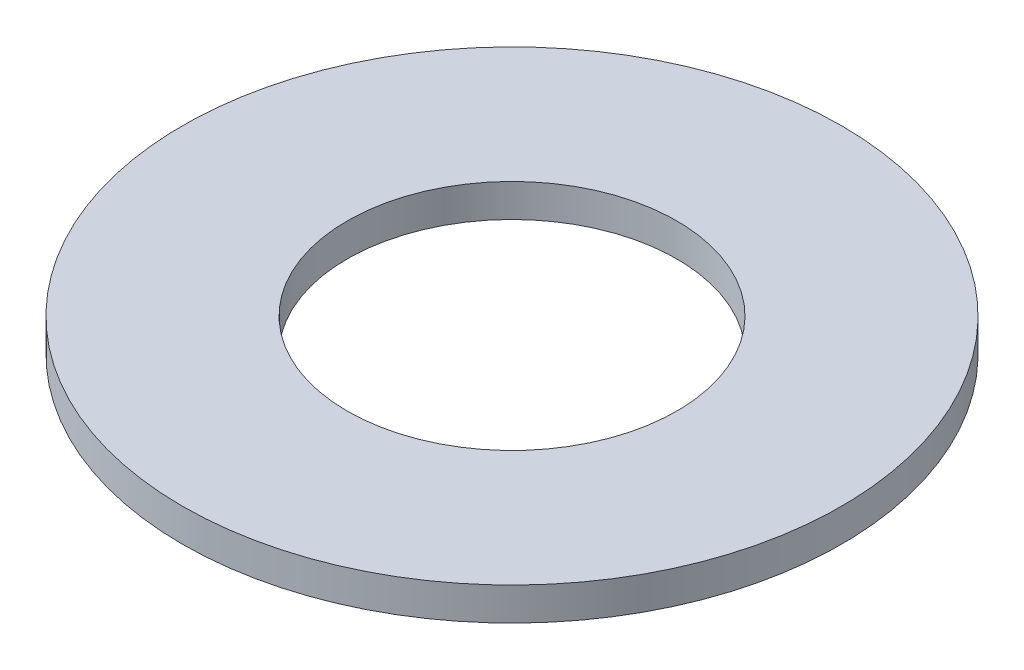
ISO-10303-21;
HEADER;
FILE_DESCRIPTION(('STEP AP214'),'2;1');
FILE_NAME('part.step','',(''),(''),'','','');
FILE_SCHEMA(('AUTOMOTIVE_DESIGN { 1 0 10303 214 1 1 1 1 }'));
ENDSEC;
DATA;
#1=APPLICATION_CONTEXT('core data for automotive mechanical design processes');
#2=APPLICATION_PROTOCOL_DEFINITION('international standard','automotive_design',2000,#1);
#3=PRODUCT_CONTEXT('',#1,'mechanical');
#4=PRODUCT('Part','Part','',(#3));
#5=PRODUCT_RELATED_PRODUCT_CATEGORY('part','',(#4));
#6=PRODUCT_DEFINITION_FORMATION('','',#4);
#7=PRODUCT_DEFINITION_CONTEXT('part definition',#1,'design');
#8=PRODUCT_DEFINITION('design','',#6,#7);
#9=PRODUCT_DEFINITION_SHAPE('','',#8);
#10=(LENGTH_UNIT() NAMED_UNIT(*) SI_UNIT(.MILLI.,.METRE.));
#11=(NAMED_UNIT(*) PLANE_ANGLE_UNIT() SI_UNIT($,.RADIAN.));
#12=(NAMED_UNIT(*) SI_UNIT($,.STERADIAN.) SOLID_ANGLE_UNIT());
#13=UNCERTAINTY_MEASURE_WITH_UNIT(LENGTH_MEASURE(1.E-05),#10,'distance_accuracy_value','');
#14=(GEOMETRIC_REPRESENTATION_CONTEXT(3) GLOBAL_UNCERTAINTY_ASSIGNED_CONTEXT((#13)) GLOBAL_UNIT_ASSIGNED_CONTEXT((#10,
#11,#12)) REPRESENTATION_CONTEXT('',''));
#15=CARTESIAN_POINT('',(0.,0.,0.));
#16=DIRECTION('',(0.,0.,1.));
#17=DIRECTION('',(1.,0.,0.));
#18=AXIS2_PLACEMENT_3D('',#15,#16,#17);
#19=CARTESIAN_POINT('',(0.,1.,0.));
#20=DIRECTION('',(0.,1.,0.));
#21=DIRECTION('',(0.,0.,1.));
#22=AXIS2_PLACEMENT_3D('',#19,#20,#21);
#23=PLANE('',#22);
#24=CARTESIAN_POINT('',(0.,1.,0.));
#25=DIRECTION('',(0.,1.,0.));
#26=DIRECTION('',(0.,0.,1.));
#27=AXIS2_PLACEMENT_3D('',#24,#25,#26);
#28=CIRCLE('',#27,10.);
#29=CARTESIAN_POINT('',(0.,1.,10.));
#30=VERTEX_POINT('',#29);
#31=EDGE_CURVE('E10',#30,#30,#28,.T.);
#32=ORIENTED_EDGE('',*,*,#31,.T.);
#33=EDGE_LOOP('',(#32));
#34=FACE_BOUND('',#33,.T.);
#35=CARTESIAN_POINT('',(0.,1.,0.));
#36=DIRECTION('',(0.,1.,0.));
#37=DIRECTION('',(0.,0.,1.));
#38=AXIS2_PLACEMENT_3D('',#35,#36,#37);
#39=CIRCLE('',#38,5.);
#40=CARTESIAN_POINT('',(0.,1.,5.));
#41=VERTEX_POINT('',#40);
#42=EDGE_CURVE('E42',#41,#41,#39,.T.);
#43=ORIENTED_EDGE('',*,*,#42,.F.);
#44=EDGE_LOOP('',(#43));
#45=FACE_BOUND('',#44,.T.);
#46=ADVANCED_FACE('F31',(#34,#45),#23,.T.);
#47=CARTESIAN_POINT('',(0.,0.,0.));
#48=DIRECTION('',(0.,1.,0.));
#49=DIRECTION('',(0.,0.,1.));
#50=AXIS2_PLACEMENT_3D('',#47,#48,#49);
#51=PLANE('',#50);
#52=CARTESIAN_POINT('',(0.,0.,0.));
#53=DIRECTION('',(0.,1.,0.));
#54=DIRECTION('',(0.,0.,1.));
#55=AXIS2_PLACEMENT_3D('',#52,#53,#54);
#56=CIRCLE('',#55,10.);
#57=CARTESIAN_POINT('',(0.,0.,10.));
#58=VERTEX_POINT('',#57);
#59=EDGE_CURVE('E35',#58,#58,#56,.T.);
#60=ORIENTED_EDGE('',*,*,#59,.F.);
#61=EDGE_LOOP('',(#60));
#62=FACE_BOUND('',#61,.T.);
#63=CARTESIAN_POINT('',(0.,0.,0.));
#64=DIRECTION('',(0.,1.,0.));
#65=DIRECTION('',(0.,0.,1.));
#66=AXIS2_PLACEMENT_3D('',#63,#64,#65);
#67=CIRCLE('',#66,5.);
#68=CARTESIAN_POINT('',(0.,0.,5.));
#69=VERTEX_POINT('',#68);
#70=EDGE_CURVE('E44',#69,#69,#67,.T.);
#71=ORIENTED_EDGE('',*,*,#70,.T.);
#72=EDGE_LOOP('',(#71));
#73=FACE_BOUND('',#72,.T.);
#74=ADVANCED_FACE('F54',(#62,#73),#51,.F.);
#75=CARTESIAN_POINT('',(0.,1.,0.));
#76=DIRECTION('',(0.,-1.,0.));
#77=DIRECTION('',(0.,0.,-1.));
#78=AXIS2_PLACEMENT_3D('',#75,#76,#77);
#79=CYLINDRICAL_SURFACE('',#78,10.);
#80=ORIENTED_EDGE('',*,*,#31,.F.);
#81=EDGE_LOOP('',(#80));
#82=FACE_BOUND('',#81,.T.);
#83=ORIENTED_EDGE('',*,*,#59,.T.);
#84=EDGE_LOOP('',(#83));
#85=FACE_BOUND('',#84,.T.);
#86=ADVANCED_FACE('F33',(#82,#85),#79,.T.);
#87=CARTESIAN_POINT('',(0.,1.,0.));
#88=DIRECTION('',(0.,-1.,0.));
#89=DIRECTION('',(0.,0.,-1.));
#90=AXIS2_PLACEMENT_3D('',#87,#88,#89);
#91=CYLINDRICAL_SURFACE('',#90,5.);
#92=ORIENTED_EDGE('',*,*,#42,.T.);
#93=EDGE_LOOP('',(#92));
#94=FACE_BOUND('',#93,.T.);
#95=ORIENTED_EDGE('',*,*,#70,.F.);
#96=EDGE_LOOP('',(#95));
#97=FACE_BOUND('',#96,.T.);
#98=ADVANCED_FACE('F50',(#94,#97),#91,.F.);
#99=CLOSED_SHELL('',(#46,#74,#86,#98));
#100=MANIFOLD_SOLID_BREP('B2',#99);
#101=ADVANCED_BREP_SHAPE_REPRESENTATION('',(#18,#100),#14);
#102=SHAPE_DEFINITION_REPRESENTATION(#9,#101);
ENDSEC;
END-ISO-10303-21;
